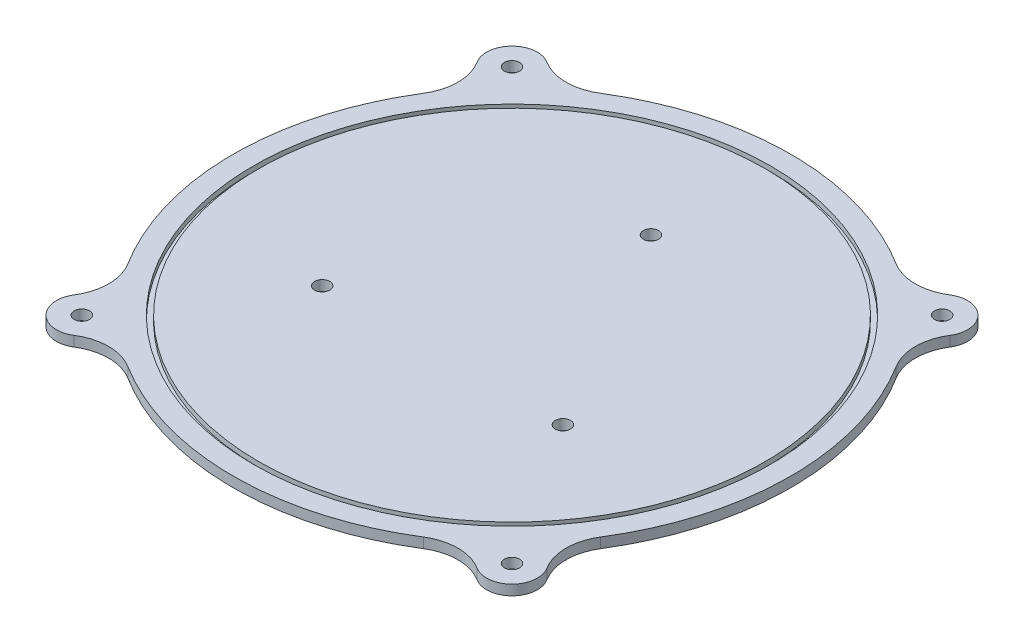
ISO-10303-21;
HEADER;
FILE_DESCRIPTION(('STEP AP214'),'2;1');
FILE_NAME('part.step','',(''),(''),'','','');
FILE_SCHEMA(('AUTOMOTIVE_DESIGN { 1 0 10303 214 1 1 1 1 }'));
ENDSEC;
DATA;
#1=APPLICATION_CONTEXT('core data for automotive mechanical design processes');
#2=APPLICATION_PROTOCOL_DEFINITION('international standard','automotive_design',2000,#1);
#3=PRODUCT_CONTEXT('',#1,'mechanical');
#4=PRODUCT('Part','Part','',(#3));
#5=PRODUCT_RELATED_PRODUCT_CATEGORY('part','',(#4));
#6=PRODUCT_DEFINITION_FORMATION('','',#4);
#7=PRODUCT_DEFINITION_CONTEXT('part definition',#1,'design');
#8=PRODUCT_DEFINITION('design','',#6,#7);
#9=PRODUCT_DEFINITION_SHAPE('','',#8);
#10=(LENGTH_UNIT() NAMED_UNIT(*) SI_UNIT(.MILLI.,.METRE.));
#11=(NAMED_UNIT(*) PLANE_ANGLE_UNIT() SI_UNIT($,.RADIAN.));
#12=(NAMED_UNIT(*) SI_UNIT($,.STERADIAN.) SOLID_ANGLE_UNIT());
#13=UNCERTAINTY_MEASURE_WITH_UNIT(LENGTH_MEASURE(1.E-05),#10,'distance_accuracy_value','');
#14=(GEOMETRIC_REPRESENTATION_CONTEXT(3) GLOBAL_UNCERTAINTY_ASSIGNED_CONTEXT((#13)) GLOBAL_UNIT_ASSIGNED_CONTEXT((#10,
#11,#12)) REPRESENTATION_CONTEXT('',''));
#15=CARTESIAN_POINT('',(0.,0.,0.));
#16=DIRECTION('',(0.,0.,1.));
#17=DIRECTION('',(1.,0.,0.));
#18=AXIS2_PLACEMENT_3D('',#15,#16,#17);
#19=CARTESIAN_POINT('',(-48.7756155256668,2.,-38.434220820674));
#20=DIRECTION('',(0.,1.,0.));
#21=DIRECTION('',(0.,0.,1.));
#22=AXIS2_PLACEMENT_3D('',#19,#20,#21);
#23=PLANE('',#22);
#24=CARTESIAN_POINT('',(0.,2.,-27.4139408136261));
#25=DIRECTION('',(0.,1.,0.));
#26=DIRECTION('',(0.,0.,1.));
#27=AXIS2_PLACEMENT_3D('',#24,#25,#26);
#28=CIRCLE('',#27,1.5);
#29=CARTESIAN_POINT('',(0.,2.,-25.9139408136261));
#30=VERTEX_POINT('',#29);
#31=EDGE_CURVE('E530',#30,#30,#28,.T.);
#32=ORIENTED_EDGE('',*,*,#31,.F.);
#33=EDGE_LOOP('',(#32));
#34=FACE_BOUND('',#33,.T.);
#35=CARTESIAN_POINT('',(-23.7411691624432,2.,13.706970406813));
#36=DIRECTION('',(0.,1.,0.));
#37=DIRECTION('',(0.,0.,1.));
#38=AXIS2_PLACEMENT_3D('',#35,#36,#37);
#39=CIRCLE('',#38,1.5);
#40=CARTESIAN_POINT('',(-23.7411691624432,2.,15.206970406813));
#41=VERTEX_POINT('',#40);
#42=EDGE_CURVE('E183',#41,#41,#39,.T.);
#43=ORIENTED_EDGE('',*,*,#42,.F.);
#44=EDGE_LOOP('',(#43));
#45=FACE_BOUND('',#44,.T.);
#46=CARTESIAN_POINT('',(23.7411691624432,2.,13.706970406813));
#47=DIRECTION('',(0.,1.,0.));
#48=DIRECTION('',(0.,0.,1.));
#49=AXIS2_PLACEMENT_3D('',#46,#47,#48);
#50=CIRCLE('',#49,1.50000000000002);
#51=CARTESIAN_POINT('',(23.7411691624432,2.,15.2069704068131));
#52=VERTEX_POINT('',#51);
#53=EDGE_CURVE('E536',#52,#52,#50,.T.);
#54=ORIENTED_EDGE('',*,*,#53,.F.);
#55=EDGE_LOOP('',(#54));
#56=FACE_BOUND('',#55,.T.);
#57=CARTESIAN_POINT('',(0.,2.,0.));
#58=DIRECTION('',(0.,1.,0.));
#59=DIRECTION('',(0.,0.,1.));
#60=AXIS2_PLACEMENT_3D('',#57,#58,#59);
#61=CIRCLE('',#60,50.);
#62=CARTESIAN_POINT('',(0.,2.,50.));
#63=VERTEX_POINT('',#62);
#64=EDGE_CURVE('E494',#63,#63,#61,.T.);
#65=ORIENTED_EDGE('',*,*,#64,.T.);
#66=EDGE_LOOP('',(#65));
#67=FACE_BOUND('',#66,.T.);
#68=ADVANCED_FACE('F33',(#34,#45,#56,#67),#23,.T.);
#69=CARTESIAN_POINT('',(0.,2.,0.));
#70=DIRECTION('',(0.,1.,0.));
#71=DIRECTION('',(0.,0.,1.));
#72=AXIS2_PLACEMENT_3D('',#69,#70,#71);
#73=CIRCLE('',#72,51.);
#74=CARTESIAN_POINT('',(0.,2.,51.));
#75=VERTEX_POINT('',#74);
#76=EDGE_CURVE('E497',#75,#75,#73,.T.);
#77=ORIENTED_EDGE('',*,*,#76,.F.);
#78=EDGE_LOOP('',(#77));
#79=FACE_BOUND('',#78,.T.);
#80=CARTESIAN_POINT('',(42.4264068711928,2.,42.4264068711929));
#81=DIRECTION('',(0.,1.,0.));
#82=DIRECTION('',(0.,0.,1.));
#83=AXIS2_PLACEMENT_3D('',#80,#81,#82);
#84=CIRCLE('',#83,1.5);
#85=CARTESIAN_POINT('',(42.4264068711928,2.,43.9264068711929));
#86=VERTEX_POINT('',#85);
#87=EDGE_CURVE('E512',#86,#86,#84,.T.);
#88=ORIENTED_EDGE('',*,*,#87,.F.);
#89=EDGE_LOOP('',(#88));
#90=FACE_BOUND('',#89,.T.);
#91=CARTESIAN_POINT('',(-42.4264068711931,2.,-42.4264068711926));
#92=DIRECTION('',(0.,1.,0.));
#93=DIRECTION('',(0.,0.,1.));
#94=AXIS2_PLACEMENT_3D('',#91,#92,#93);
#95=CIRCLE('',#94,1.49999999999999);
#96=CARTESIAN_POINT('',(-42.4264068711931,2.,-40.9264068711926));
#97=VERTEX_POINT('',#96);
#98=EDGE_CURVE('E524',#97,#97,#95,.T.);
#99=ORIENTED_EDGE('',*,*,#98,.F.);
#100=EDGE_LOOP('',(#99));
#101=FACE_BOUND('',#100,.T.);
#102=CARTESIAN_POINT('',(-55.1248241801406,2.,-34.4420347701553));
#103=DIRECTION('',(0.,-1.,0.));
#104=DIRECTION('',(0.,0.,1.));
#105=AXIS2_PLACEMENT_3D('',#102,#103,#104);
#106=CIRCLE('',#105,10.);
#107=CARTESIAN_POINT('',(-46.6592126408422,2.,-39.7649495041802));
#108=VERTEX_POINT('',#107);
#109=CARTESIAN_POINT('',(-46.6440819985805,2.,-29.1432601901315));
#110=VERTEX_POINT('',#109);
#111=EDGE_CURVE('E210',#108,#110,#106,.T.);
#112=ORIENTED_EDGE('',*,*,#111,.T.);
#113=CARTESIAN_POINT('',(0.,2.,0.));
#114=DIRECTION('',(0.,1.,0.));
#115=DIRECTION('',(0.,0.,1.));
#116=AXIS2_PLACEMENT_3D('',#113,#114,#115);
#117=CIRCLE('',#116,55.);
#118=CARTESIAN_POINT('',(-46.6440819985802,2.,29.1432601901319));
#119=VERTEX_POINT('',#118);
#120=EDGE_CURVE('E117',#110,#119,#117,.T.);
#121=ORIENTED_EDGE('',*,*,#120,.T.);
#122=CARTESIAN_POINT('',(-55.1248241801402,2.,34.4420347701559));
#123=DIRECTION('',(0.,-1.,0.));
#124=DIRECTION('',(0.,0.,1.));
#125=AXIS2_PLACEMENT_3D('',#122,#123,#124);
#126=CIRCLE('',#125,9.99999999999999);
#127=CARTESIAN_POINT('',(-46.6592126408418,2.,39.7649495041807));
#128=VERTEX_POINT('',#127);
#129=EDGE_CURVE('E249',#119,#128,#126,.T.);
#130=ORIENTED_EDGE('',*,*,#129,.T.);
#131=CARTESIAN_POINT('',(-42.4264068711931,2.,42.4264068711926));
#132=DIRECTION('',(0.,1.,0.));
#133=DIRECTION('',(0.,0.,1.));
#134=AXIS2_PLACEMENT_3D('',#131,#132,#133);
#135=CIRCLE('',#134,4.99999999999971);
#136=CARTESIAN_POINT('',(-39.7649495041808,2.,46.6592126408416));
#137=VERTEX_POINT('',#136);
#138=EDGE_CURVE('E268',#128,#137,#135,.T.);
#139=ORIENTED_EDGE('',*,*,#138,.T.);
#140=CARTESIAN_POINT('',(-34.4420347701559,2.,55.1248241801402));
#141=DIRECTION('',(0.,-1.,0.));
#142=DIRECTION('',(0.,0.,1.));
#143=AXIS2_PLACEMENT_3D('',#140,#141,#142);
#144=CIRCLE('',#143,10.);
#145=CARTESIAN_POINT('',(-29.1432601901319,2.,46.6440819985802));
#146=VERTEX_POINT('',#145);
#147=EDGE_CURVE('E265',#137,#146,#144,.T.);
#148=ORIENTED_EDGE('',*,*,#147,.T.);
#149=CARTESIAN_POINT('',(0.,2.,0.));
#150=DIRECTION('',(0.,1.,0.));
#151=DIRECTION('',(0.,0.,1.));
#152=AXIS2_PLACEMENT_3D('',#149,#150,#151);
#153=CIRCLE('',#152,55.);
#154=CARTESIAN_POINT('',(29.143260190132,2.,46.6440819985802));
#155=VERTEX_POINT('',#154);
#156=EDGE_CURVE('E267',#146,#155,#153,.T.);
#157=ORIENTED_EDGE('',*,*,#156,.T.);
#158=CARTESIAN_POINT('',(34.4420347701555,2.,55.1248241801404));
#159=DIRECTION('',(0.,-1.,0.));
#160=DIRECTION('',(0.,0.,1.));
#161=AXIS2_PLACEMENT_3D('',#158,#159,#160);
#162=CIRCLE('',#161,10.);
#163=CARTESIAN_POINT('',(39.7649495041804,2.,46.6592126408421));
#164=VERTEX_POINT('',#163);
#165=EDGE_CURVE('E270',#155,#164,#162,.T.);
#166=ORIENTED_EDGE('',*,*,#165,.T.);
#167=CARTESIAN_POINT('',(42.4264068711928,2.,42.4264068711929));
#168=DIRECTION('',(0.,1.,0.));
#169=DIRECTION('',(0.,0.,1.));
#170=AXIS2_PLACEMENT_3D('',#167,#168,#169);
#171=CIRCLE('',#170,5.);
#172=CARTESIAN_POINT('',(46.659212640842,2.,39.7649495041805));
#173=VERTEX_POINT('',#172);
#174=EDGE_CURVE('E276',#164,#173,#171,.T.);
#175=ORIENTED_EDGE('',*,*,#174,.T.);
#176=CARTESIAN_POINT('',(55.1248241801403,2.,34.4420347701557));
#177=DIRECTION('',(0.,-1.,0.));
#178=DIRECTION('',(0.,0.,1.));
#179=AXIS2_PLACEMENT_3D('',#176,#177,#178);
#180=CIRCLE('',#179,10.);
#181=CARTESIAN_POINT('',(46.6440819985803,2.,29.1432601901318));
#182=VERTEX_POINT('',#181);
#183=EDGE_CURVE('E278',#173,#182,#180,.T.);
#184=ORIENTED_EDGE('',*,*,#183,.T.);
#185=CARTESIAN_POINT('',(0.,2.,0.));
#186=DIRECTION('',(0.,1.,0.));
#187=DIRECTION('',(0.,0.,1.));
#188=AXIS2_PLACEMENT_3D('',#185,#186,#187);
#189=CIRCLE('',#188,55.);
#190=CARTESIAN_POINT('',(46.64408199858,2.,-29.1432601901322));
#191=VERTEX_POINT('',#190);
#192=EDGE_CURVE('E280',#182,#191,#189,.T.);
#193=ORIENTED_EDGE('',*,*,#192,.T.);
#194=CARTESIAN_POINT('',(55.1248241801403,2.,-34.4420347701558));
#195=DIRECTION('',(0.,-1.,0.));
#196=DIRECTION('',(0.,0.,1.));
#197=AXIS2_PLACEMENT_3D('',#194,#195,#196);
#198=CIRCLE('',#197,10.);
#199=CARTESIAN_POINT('',(46.6592126408419,2.,-39.7649495041805));
#200=VERTEX_POINT('',#199);
#201=EDGE_CURVE('E282',#191,#200,#198,.T.);
#202=ORIENTED_EDGE('',*,*,#201,.T.);
#203=CARTESIAN_POINT('',(42.4264068711928,2.,-42.4264068711929));
#204=DIRECTION('',(0.,1.,0.));
#205=DIRECTION('',(0.,0.,1.));
#206=AXIS2_PLACEMENT_3D('',#203,#204,#205);
#207=CIRCLE('',#206,4.99999999999999);
#208=CARTESIAN_POINT('',(39.7649495041804,2.,-46.6592126408421));
#209=VERTEX_POINT('',#208);
#210=EDGE_CURVE('E284',#200,#209,#207,.T.);
#211=ORIENTED_EDGE('',*,*,#210,.T.);
#212=CARTESIAN_POINT('',(34.4420347701555,2.,-55.1248241801405));
#213=DIRECTION('',(0.,-1.,0.));
#214=DIRECTION('',(0.,0.,1.));
#215=AXIS2_PLACEMENT_3D('',#212,#213,#214);
#216=CIRCLE('',#215,10.);
#217=CARTESIAN_POINT('',(29.1432601901316,2.,-46.6440819985804));
#218=VERTEX_POINT('',#217);
#219=EDGE_CURVE('E161',#209,#218,#216,.T.);
#220=ORIENTED_EDGE('',*,*,#219,.T.);
#221=CARTESIAN_POINT('',(0.,2.,0.));
#222=DIRECTION('',(0.,1.,0.));
#223=DIRECTION('',(0.,0.,1.));
#224=AXIS2_PLACEMENT_3D('',#221,#222,#223);
#225=CIRCLE('',#224,55.);
#226=CARTESIAN_POINT('',(-29.1432601901319,2.,-46.6440819985802));
#227=VERTEX_POINT('',#226);
#228=EDGE_CURVE('E154',#218,#227,#225,.T.);
#229=ORIENTED_EDGE('',*,*,#228,.T.);
#230=CARTESIAN_POINT('',(-34.4420347701559,2.,-55.1248241801402));
#231=DIRECTION('',(0.,-1.,0.));
#232=DIRECTION('',(0.,0.,1.));
#233=AXIS2_PLACEMENT_3D('',#230,#231,#232);
#234=CIRCLE('',#233,10.);
#235=CARTESIAN_POINT('',(-39.7649495041807,2.,-46.6592126408418));
#236=VERTEX_POINT('',#235);
#237=EDGE_CURVE('E159',#227,#236,#234,.T.);
#238=ORIENTED_EDGE('',*,*,#237,.T.);
#239=CARTESIAN_POINT('',(-42.4264068711931,2.,-42.4264068711926));
#240=DIRECTION('',(0.,1.,0.));
#241=DIRECTION('',(0.,0.,1.));
#242=AXIS2_PLACEMENT_3D('',#239,#240,#241);
#243=CIRCLE('',#242,5.);
#244=EDGE_CURVE('E50',#236,#108,#243,.T.);
#245=ORIENTED_EDGE('',*,*,#244,.T.);
#246=EDGE_LOOP('',(#112,#121,#130,#139,#148,#157,#166,#175,#184,#193,#202,#211,#220,#229,#238,#245));
#247=FACE_BOUND('',#246,.T.);
#248=CARTESIAN_POINT('',(42.4264068711928,2.,-42.4264068711929));
#249=DIRECTION('',(0.,1.,0.));
#250=DIRECTION('',(0.,0.,1.));
#251=AXIS2_PLACEMENT_3D('',#248,#249,#250);
#252=CIRCLE('',#251,1.50000000000001);
#253=CARTESIAN_POINT('',(42.4264068711928,2.,-40.9264068711929));
#254=VERTEX_POINT('',#253);
#255=EDGE_CURVE('E518',#254,#254,#252,.T.);
#256=ORIENTED_EDGE('',*,*,#255,.F.);
#257=EDGE_LOOP('',(#256));
#258=FACE_BOUND('',#257,.T.);
#259=CARTESIAN_POINT('',(-42.4264068711931,2.,42.4264068711926));
#260=DIRECTION('',(0.,1.,0.));
#261=DIRECTION('',(0.,0.,1.));
#262=AXIS2_PLACEMENT_3D('',#259,#260,#261);
#263=CIRCLE('',#262,1.50000000000001);
#264=CARTESIAN_POINT('',(-42.4264068711931,2.,43.9264068711926));
#265=VERTEX_POINT('',#264);
#266=EDGE_CURVE('E506',#265,#265,#263,.T.);
#267=ORIENTED_EDGE('',*,*,#266,.F.);
#268=EDGE_LOOP('',(#267));
#269=FACE_BOUND('',#268,.T.);
#270=ADVANCED_FACE('F156',(#79,#90,#101,#247,#258,#269),#23,.T.);
#271=CARTESIAN_POINT('',(-48.7756155256668,0.,-38.434220820674));
#272=DIRECTION('',(0.,1.,0.));
#273=DIRECTION('',(0.,0.,1.));
#274=AXIS2_PLACEMENT_3D('',#271,#272,#273);
#275=PLANE('',#274);
#276=CARTESIAN_POINT('',(-55.1248241801406,0.,-34.4420347701553));
#277=DIRECTION('',(0.,-1.,0.));
#278=DIRECTION('',(0.,0.,1.));
#279=AXIS2_PLACEMENT_3D('',#276,#277,#278);
#280=CIRCLE('',#279,10.);
#281=CARTESIAN_POINT('',(-46.6592126408422,0.,-39.7649495041802));
#282=VERTEX_POINT('',#281);
#283=CARTESIAN_POINT('',(-46.6440819985805,0.,-29.1432601901315));
#284=VERTEX_POINT('',#283);
#285=EDGE_CURVE('E179',#282,#284,#280,.T.);
#286=ORIENTED_EDGE('',*,*,#285,.F.);
#287=CARTESIAN_POINT('',(-42.4264068711931,0.,-42.4264068711926));
#288=DIRECTION('',(0.,1.,0.));
#289=DIRECTION('',(0.,0.,1.));
#290=AXIS2_PLACEMENT_3D('',#287,#288,#289);
#291=CIRCLE('',#290,5.);
#292=CARTESIAN_POINT('',(-39.7649495041807,0.,-46.6592126408418));
#293=VERTEX_POINT('',#292);
#294=EDGE_CURVE('E109',#293,#282,#291,.T.);
#295=ORIENTED_EDGE('',*,*,#294,.F.);
#296=CARTESIAN_POINT('',(-34.4420347701559,0.,-55.1248241801402));
#297=DIRECTION('',(0.,-1.,0.));
#298=DIRECTION('',(0.,0.,1.));
#299=AXIS2_PLACEMENT_3D('',#296,#297,#298);
#300=CIRCLE('',#299,10.);
#301=CARTESIAN_POINT('',(-29.1432601901319,0.,-46.6440819985802));
#302=VERTEX_POINT('',#301);
#303=EDGE_CURVE('E103',#302,#293,#300,.T.);
#304=ORIENTED_EDGE('',*,*,#303,.F.);
#305=CARTESIAN_POINT('',(0.,0.,0.));
#306=DIRECTION('',(0.,1.,0.));
#307=DIRECTION('',(0.,0.,1.));
#308=AXIS2_PLACEMENT_3D('',#305,#306,#307);
#309=CIRCLE('',#308,55.);
#310=CARTESIAN_POINT('',(29.1432601901316,0.,-46.6440819985804));
#311=VERTEX_POINT('',#310);
#312=EDGE_CURVE('E169',#311,#302,#309,.T.);
#313=ORIENTED_EDGE('',*,*,#312,.F.);
#314=CARTESIAN_POINT('',(34.4420347701555,0.,-55.1248241801405));
#315=DIRECTION('',(0.,-1.,0.));
#316=DIRECTION('',(0.,0.,1.));
#317=AXIS2_PLACEMENT_3D('',#314,#315,#316);
#318=CIRCLE('',#317,10.);
#319=CARTESIAN_POINT('',(39.7649495041804,0.,-46.6592126408421));
#320=VERTEX_POINT('',#319);
#321=EDGE_CURVE('E205',#320,#311,#318,.T.);
#322=ORIENTED_EDGE('',*,*,#321,.F.);
#323=CARTESIAN_POINT('',(42.4264068711928,0.,-42.4264068711929));
#324=DIRECTION('',(0.,1.,0.));
#325=DIRECTION('',(0.,0.,1.));
#326=AXIS2_PLACEMENT_3D('',#323,#324,#325);
#327=CIRCLE('',#326,4.99999999999999);
#328=CARTESIAN_POINT('',(46.6592126408419,0.,-39.7649495041805));
#329=VERTEX_POINT('',#328);
#330=EDGE_CURVE('E203',#329,#320,#327,.T.);
#331=ORIENTED_EDGE('',*,*,#330,.F.);
#332=CARTESIAN_POINT('',(55.1248241801403,0.,-34.4420347701558));
#333=DIRECTION('',(0.,-1.,0.));
#334=DIRECTION('',(0.,0.,1.));
#335=AXIS2_PLACEMENT_3D('',#332,#333,#334);
#336=CIRCLE('',#335,10.);
#337=CARTESIAN_POINT('',(46.64408199858,0.,-29.1432601901322));
#338=VERTEX_POINT('',#337);
#339=EDGE_CURVE('E201',#338,#329,#336,.T.);
#340=ORIENTED_EDGE('',*,*,#339,.F.);
#341=CARTESIAN_POINT('',(0.,0.,0.));
#342=DIRECTION('',(0.,1.,0.));
#343=DIRECTION('',(0.,0.,1.));
#344=AXIS2_PLACEMENT_3D('',#341,#342,#343);
#345=CIRCLE('',#344,55.);
#346=CARTESIAN_POINT('',(46.6440819985803,0.,29.1432601901318));
#347=VERTEX_POINT('',#346);
#348=EDGE_CURVE('E199',#347,#338,#345,.T.);
#349=ORIENTED_EDGE('',*,*,#348,.F.);
#350=CARTESIAN_POINT('',(55.1248241801403,0.,34.4420347701557));
#351=DIRECTION('',(0.,-1.,0.));
#352=DIRECTION('',(0.,0.,1.));
#353=AXIS2_PLACEMENT_3D('',#350,#351,#352);
#354=CIRCLE('',#353,10.);
#355=CARTESIAN_POINT('',(46.659212640842,0.,39.7649495041805));
#356=VERTEX_POINT('',#355);
#357=EDGE_CURVE('E197',#356,#347,#354,.T.);
#358=ORIENTED_EDGE('',*,*,#357,.F.);
#359=CARTESIAN_POINT('',(42.4264068711928,0.,42.4264068711929));
#360=DIRECTION('',(0.,1.,0.));
#361=DIRECTION('',(0.,0.,1.));
#362=AXIS2_PLACEMENT_3D('',#359,#360,#361);
#363=CIRCLE('',#362,5.);
#364=CARTESIAN_POINT('',(39.7649495041804,0.,46.6592126408421));
#365=VERTEX_POINT('',#364);
#366=EDGE_CURVE('E195',#365,#356,#363,.T.);
#367=ORIENTED_EDGE('',*,*,#366,.F.);
#368=CARTESIAN_POINT('',(34.4420347701555,0.,55.1248241801404));
#369=DIRECTION('',(0.,-1.,0.));
#370=DIRECTION('',(0.,0.,1.));
#371=AXIS2_PLACEMENT_3D('',#368,#369,#370);
#372=CIRCLE('',#371,10.);
#373=CARTESIAN_POINT('',(29.143260190132,0.,46.6440819985802));
#374=VERTEX_POINT('',#373);
#375=EDGE_CURVE('E193',#374,#365,#372,.T.);
#376=ORIENTED_EDGE('',*,*,#375,.F.);
#377=CARTESIAN_POINT('',(0.,0.,0.));
#378=DIRECTION('',(0.,1.,0.));
#379=DIRECTION('',(0.,0.,1.));
#380=AXIS2_PLACEMENT_3D('',#377,#378,#379);
#381=CIRCLE('',#380,55.);
#382=CARTESIAN_POINT('',(-29.1432601901319,0.,46.6440819985802));
#383=VERTEX_POINT('',#382);
#384=EDGE_CURVE('E191',#383,#374,#381,.T.);
#385=ORIENTED_EDGE('',*,*,#384,.F.);
#386=CARTESIAN_POINT('',(-34.4420347701559,0.,55.1248241801402));
#387=DIRECTION('',(0.,-1.,0.));
#388=DIRECTION('',(0.,0.,1.));
#389=AXIS2_PLACEMENT_3D('',#386,#387,#388);
#390=CIRCLE('',#389,10.);
#391=CARTESIAN_POINT('',(-39.7649495041808,0.,46.6592126408416));
#392=VERTEX_POINT('',#391);
#393=EDGE_CURVE('E189',#392,#383,#390,.T.);
#394=ORIENTED_EDGE('',*,*,#393,.F.);
#395=CARTESIAN_POINT('',(-42.4264068711931,0.,42.4264068711926));
#396=DIRECTION('',(0.,1.,0.));
#397=DIRECTION('',(0.,0.,1.));
#398=AXIS2_PLACEMENT_3D('',#395,#396,#397);
#399=CIRCLE('',#398,4.99999999999971);
#400=CARTESIAN_POINT('',(-46.6592126408418,0.,39.7649495041807));
#401=VERTEX_POINT('',#400);
#402=EDGE_CURVE('E187',#401,#392,#399,.T.);
#403=ORIENTED_EDGE('',*,*,#402,.F.);
#404=CARTESIAN_POINT('',(-55.1248241801402,0.,34.4420347701559));
#405=DIRECTION('',(0.,-1.,0.));
#406=DIRECTION('',(0.,0.,1.));
#407=AXIS2_PLACEMENT_3D('',#404,#405,#406);
#408=CIRCLE('',#407,9.99999999999999);
#409=CARTESIAN_POINT('',(-46.6440819985802,0.,29.1432601901319));
#410=VERTEX_POINT('',#409);
#411=EDGE_CURVE('E185',#410,#401,#408,.T.);
#412=ORIENTED_EDGE('',*,*,#411,.F.);
#413=CARTESIAN_POINT('',(0.,0.,0.));
#414=DIRECTION('',(0.,1.,0.));
#415=DIRECTION('',(0.,0.,1.));
#416=AXIS2_PLACEMENT_3D('',#413,#414,#415);
#417=CIRCLE('',#416,55.);
#418=EDGE_CURVE('E182',#284,#410,#417,.T.);
#419=ORIENTED_EDGE('',*,*,#418,.F.);
#420=EDGE_LOOP('',(#286,#295,#304,#313,#322,#331,#340,#349,#358,#367,#376,#385,#394,#403,#412,#419));
#421=FACE_BOUND('',#420,.T.);
#422=CARTESIAN_POINT('',(-23.7411691624432,0.,13.706970406813));
#423=DIRECTION('',(0.,1.,0.));
#424=DIRECTION('',(0.,0.,1.));
#425=AXIS2_PLACEMENT_3D('',#422,#423,#424);
#426=CIRCLE('',#425,1.5);
#427=CARTESIAN_POINT('',(-23.7411691624432,0.,15.206970406813));
#428=VERTEX_POINT('',#427);
#429=EDGE_CURVE('E539',#428,#428,#426,.T.);
#430=ORIENTED_EDGE('',*,*,#429,.T.);
#431=EDGE_LOOP('',(#430));
#432=FACE_BOUND('',#431,.T.);
#433=CARTESIAN_POINT('',(23.7411691624432,0.,13.706970406813));
#434=DIRECTION('',(0.,1.,0.));
#435=DIRECTION('',(0.,0.,1.));
#436=AXIS2_PLACEMENT_3D('',#433,#434,#435);
#437=CIRCLE('',#436,1.50000000000002);
#438=CARTESIAN_POINT('',(23.7411691624432,0.,15.2069704068131));
#439=VERTEX_POINT('',#438);
#440=EDGE_CURVE('E533',#439,#439,#437,.T.);
#441=ORIENTED_EDGE('',*,*,#440,.T.);
#442=EDGE_LOOP('',(#441));
#443=FACE_BOUND('',#442,.T.);
#444=CARTESIAN_POINT('',(0.,0.,-27.4139408136261));
#445=DIRECTION('',(0.,1.,0.));
#446=DIRECTION('',(0.,0.,1.));
#447=AXIS2_PLACEMENT_3D('',#444,#445,#446);
#448=CIRCLE('',#447,1.5);
#449=CARTESIAN_POINT('',(0.,0.,-25.9139408136261));
#450=VERTEX_POINT('',#449);
#451=EDGE_CURVE('E527',#450,#450,#448,.T.);
#452=ORIENTED_EDGE('',*,*,#451,.T.);
#453=EDGE_LOOP('',(#452));
#454=FACE_BOUND('',#453,.T.);
#455=CARTESIAN_POINT('',(-42.4264068711931,0.,-42.4264068711926));
#456=DIRECTION('',(0.,1.,0.));
#457=DIRECTION('',(0.,0.,1.));
#458=AXIS2_PLACEMENT_3D('',#455,#456,#457);
#459=CIRCLE('',#458,1.49999999999999);
#460=CARTESIAN_POINT('',(-42.4264068711931,0.,-40.9264068711926));
#461=VERTEX_POINT('',#460);
#462=EDGE_CURVE('E521',#461,#461,#459,.T.);
#463=ORIENTED_EDGE('',*,*,#462,.T.);
#464=EDGE_LOOP('',(#463));
#465=FACE_BOUND('',#464,.T.);
#466=CARTESIAN_POINT('',(42.4264068711928,0.,-42.4264068711929));
#467=DIRECTION('',(0.,1.,0.));
#468=DIRECTION('',(0.,0.,1.));
#469=AXIS2_PLACEMENT_3D('',#466,#467,#468);
#470=CIRCLE('',#469,1.50000000000001);
#471=CARTESIAN_POINT('',(42.4264068711928,0.,-40.9264068711929));
#472=VERTEX_POINT('',#471);
#473=EDGE_CURVE('E515',#472,#472,#470,.T.);
#474=ORIENTED_EDGE('',*,*,#473,.T.);
#475=EDGE_LOOP('',(#474));
#476=FACE_BOUND('',#475,.T.);
#477=CARTESIAN_POINT('',(42.4264068711928,0.,42.4264068711929));
#478=DIRECTION('',(0.,1.,0.));
#479=DIRECTION('',(0.,0.,1.));
#480=AXIS2_PLACEMENT_3D('',#477,#478,#479);
#481=CIRCLE('',#480,1.5);
#482=CARTESIAN_POINT('',(42.4264068711928,0.,43.9264068711929));
#483=VERTEX_POINT('',#482);
#484=EDGE_CURVE('E509',#483,#483,#481,.T.);
#485=ORIENTED_EDGE('',*,*,#484,.T.);
#486=EDGE_LOOP('',(#485));
#487=FACE_BOUND('',#486,.T.);
#488=CARTESIAN_POINT('',(-42.4264068711931,0.,42.4264068711926));
#489=DIRECTION('',(0.,1.,0.));
#490=DIRECTION('',(0.,0.,1.));
#491=AXIS2_PLACEMENT_3D('',#488,#489,#490);
#492=CIRCLE('',#491,1.50000000000001);
#493=CARTESIAN_POINT('',(-42.4264068711931,0.,43.9264068711926));
#494=VERTEX_POINT('',#493);
#495=EDGE_CURVE('E503',#494,#494,#492,.T.);
#496=ORIENTED_EDGE('',*,*,#495,.T.);
#497=EDGE_LOOP('',(#496));
#498=FACE_BOUND('',#497,.T.);
#499=ADVANCED_FACE('F253',(#421,#432,#443,#454,#465,#476,#487,#498),#275,.F.);
#500=CARTESIAN_POINT('',(-55.1248241801406,2.,-34.4420347701553));
#501=DIRECTION('',(0.,-1.,0.));
#502=DIRECTION('',(0.,0.,-1.));
#503=AXIS2_PLACEMENT_3D('',#500,#501,#502);
#504=CYLINDRICAL_SURFACE('',#503,10.);
#505=ORIENTED_EDGE('',*,*,#285,.T.);
#506=DIRECTION('',(0.,-1.,0.));
#507=VECTOR('',#506,1.);
#508=CARTESIAN_POINT('',(-46.6440819985805,2.,-29.1432601901315));
#509=LINE('',#508,#507);
#510=EDGE_CURVE('E11',#110,#284,#509,.T.);
#511=ORIENTED_EDGE('',*,*,#510,.F.);
#512=ORIENTED_EDGE('',*,*,#111,.F.);
#513=DIRECTION('',(0.,-1.,0.));
#514=VECTOR('',#513,1.);
#515=CARTESIAN_POINT('',(-46.6592126408422,2.,-39.7649495041802));
#516=LINE('',#515,#514);
#517=EDGE_CURVE('E175',#108,#282,#516,.T.);
#518=ORIENTED_EDGE('',*,*,#517,.T.);
#519=EDGE_LOOP('',(#505,#511,#512,#518));
#520=FACE_BOUND('',#519,.T.);
#521=ADVANCED_FACE('F35',(#520),#504,.F.);
#522=CARTESIAN_POINT('',(0.,2.,0.));
#523=DIRECTION('',(0.,-1.,0.));
#524=DIRECTION('',(0.,0.,-1.));
#525=AXIS2_PLACEMENT_3D('',#522,#523,#524);
#526=CYLINDRICAL_SURFACE('',#525,55.);
#527=ORIENTED_EDGE('',*,*,#418,.T.);
#528=DIRECTION('',(0.,-1.,0.));
#529=VECTOR('',#528,1.);
#530=CARTESIAN_POINT('',(-46.6440819985802,2.,29.1432601901319));
#531=LINE('',#530,#529);
#532=EDGE_CURVE('E42',#119,#410,#531,.T.);
#533=ORIENTED_EDGE('',*,*,#532,.F.);
#534=ORIENTED_EDGE('',*,*,#120,.F.);
#535=ORIENTED_EDGE('',*,*,#510,.T.);
#536=EDGE_LOOP('',(#527,#533,#534,#535));
#537=FACE_BOUND('',#536,.T.);
#538=ADVANCED_FACE('F325',(#537),#526,.T.);
#539=CARTESIAN_POINT('',(-55.1248241801402,2.,34.4420347701559));
#540=DIRECTION('',(0.,-1.,0.));
#541=DIRECTION('',(0.,0.,-1.));
#542=AXIS2_PLACEMENT_3D('',#539,#540,#541);
#543=CYLINDRICAL_SURFACE('',#542,9.99999999999999);
#544=ORIENTED_EDGE('',*,*,#411,.T.);
#545=DIRECTION('',(0.,-1.,0.));
#546=VECTOR('',#545,1.);
#547=CARTESIAN_POINT('',(-46.6592126408418,2.,39.7649495041807));
#548=LINE('',#547,#546);
#549=EDGE_CURVE('E241',#128,#401,#548,.T.);
#550=ORIENTED_EDGE('',*,*,#549,.F.);
#551=ORIENTED_EDGE('',*,*,#129,.F.);
#552=ORIENTED_EDGE('',*,*,#532,.T.);
#553=EDGE_LOOP('',(#544,#550,#551,#552));
#554=FACE_BOUND('',#553,.T.);
#555=ADVANCED_FACE('F247',(#554),#543,.F.);
#556=CARTESIAN_POINT('',(-42.4264068711931,2.,42.4264068711926));
#557=DIRECTION('',(0.,-1.,0.));
#558=DIRECTION('',(0.,0.,-1.));
#559=AXIS2_PLACEMENT_3D('',#556,#557,#558);
#560=CYLINDRICAL_SURFACE('',#559,4.99999999999971);
#561=ORIENTED_EDGE('',*,*,#402,.T.);
#562=DIRECTION('',(0.,-1.,0.));
#563=VECTOR('',#562,1.);
#564=CARTESIAN_POINT('',(-39.7649495041808,2.,46.6592126408416));
#565=LINE('',#564,#563);
#566=EDGE_CURVE('E238',#137,#392,#565,.T.);
#567=ORIENTED_EDGE('',*,*,#566,.F.);
#568=ORIENTED_EDGE('',*,*,#138,.F.);
#569=ORIENTED_EDGE('',*,*,#549,.T.);
#570=EDGE_LOOP('',(#561,#567,#568,#569));
#571=FACE_BOUND('',#570,.T.);
#572=ADVANCED_FACE('F259',(#571),#560,.T.);
#573=CARTESIAN_POINT('',(-34.4420347701559,2.,55.1248241801402));
#574=DIRECTION('',(0.,-1.,0.));
#575=DIRECTION('',(0.,0.,-1.));
#576=AXIS2_PLACEMENT_3D('',#573,#574,#575);
#577=CYLINDRICAL_SURFACE('',#576,10.);
#578=ORIENTED_EDGE('',*,*,#393,.T.);
#579=DIRECTION('',(0.,-1.,0.));
#580=VECTOR('',#579,1.);
#581=CARTESIAN_POINT('',(-29.1432601901319,2.,46.6440819985802));
#582=LINE('',#581,#580);
#583=EDGE_CURVE('E235',#146,#383,#582,.T.);
#584=ORIENTED_EDGE('',*,*,#583,.F.);
#585=ORIENTED_EDGE('',*,*,#147,.F.);
#586=ORIENTED_EDGE('',*,*,#566,.T.);
#587=EDGE_LOOP('',(#578,#584,#585,#586));
#588=FACE_BOUND('',#587,.T.);
#589=ADVANCED_FACE('F263',(#588),#577,.F.);
#590=CARTESIAN_POINT('',(0.,2.,0.));
#591=DIRECTION('',(0.,-1.,0.));
#592=DIRECTION('',(0.,0.,-1.));
#593=AXIS2_PLACEMENT_3D('',#590,#591,#592);
#594=CYLINDRICAL_SURFACE('',#593,55.);
#595=ORIENTED_EDGE('',*,*,#384,.T.);
#596=DIRECTION('',(0.,-1.,0.));
#597=VECTOR('',#596,1.);
#598=CARTESIAN_POINT('',(29.143260190132,2.,46.6440819985802));
#599=LINE('',#598,#597);
#600=EDGE_CURVE('E232',#155,#374,#599,.T.);
#601=ORIENTED_EDGE('',*,*,#600,.F.);
#602=ORIENTED_EDGE('',*,*,#156,.F.);
#603=ORIENTED_EDGE('',*,*,#583,.T.);
#604=EDGE_LOOP('',(#595,#601,#602,#603));
#605=FACE_BOUND('',#604,.T.);
#606=ADVANCED_FACE('F338',(#605),#594,.T.);
#607=CARTESIAN_POINT('',(34.4420347701555,2.,55.1248241801404));
#608=DIRECTION('',(0.,-1.,0.));
#609=DIRECTION('',(0.,0.,-1.));
#610=AXIS2_PLACEMENT_3D('',#607,#608,#609);
#611=CYLINDRICAL_SURFACE('',#610,10.);
#612=ORIENTED_EDGE('',*,*,#375,.T.);
#613=DIRECTION('',(0.,-1.,0.));
#614=VECTOR('',#613,1.);
#615=CARTESIAN_POINT('',(39.7649495041804,2.,46.6592126408421));
#616=LINE('',#615,#614);
#617=EDGE_CURVE('E229',#164,#365,#616,.T.);
#618=ORIENTED_EDGE('',*,*,#617,.F.);
#619=ORIENTED_EDGE('',*,*,#165,.F.);
#620=ORIENTED_EDGE('',*,*,#600,.T.);
#621=EDGE_LOOP('',(#612,#618,#619,#620));
#622=FACE_BOUND('',#621,.T.);
#623=ADVANCED_FACE('F341',(#622),#611,.F.);
#624=CARTESIAN_POINT('',(42.4264068711928,2.,42.4264068711929));
#625=DIRECTION('',(0.,-1.,0.));
#626=DIRECTION('',(0.,0.,-1.));
#627=AXIS2_PLACEMENT_3D('',#624,#625,#626);
#628=CYLINDRICAL_SURFACE('',#627,5.);
#629=ORIENTED_EDGE('',*,*,#366,.T.);
#630=DIRECTION('',(0.,-1.,0.));
#631=VECTOR('',#630,1.);
#632=CARTESIAN_POINT('',(46.659212640842,2.,39.7649495041805));
#633=LINE('',#632,#631);
#634=EDGE_CURVE('E226',#173,#356,#633,.T.);
#635=ORIENTED_EDGE('',*,*,#634,.F.);
#636=ORIENTED_EDGE('',*,*,#174,.F.);
#637=ORIENTED_EDGE('',*,*,#617,.T.);
#638=EDGE_LOOP('',(#629,#635,#636,#637));
#639=FACE_BOUND('',#638,.T.);
#640=ADVANCED_FACE('F345',(#639),#628,.T.);
#641=CARTESIAN_POINT('',(55.1248241801403,2.,34.4420347701557));
#642=DIRECTION('',(0.,-1.,0.));
#643=DIRECTION('',(0.,0.,-1.));
#644=AXIS2_PLACEMENT_3D('',#641,#642,#643);
#645=CYLINDRICAL_SURFACE('',#644,10.);
#646=ORIENTED_EDGE('',*,*,#357,.T.);
#647=DIRECTION('',(0.,-1.,0.));
#648=VECTOR('',#647,1.);
#649=CARTESIAN_POINT('',(46.6440819985803,2.,29.1432601901318));
#650=LINE('',#649,#648);
#651=EDGE_CURVE('E223',#182,#347,#650,.T.);
#652=ORIENTED_EDGE('',*,*,#651,.F.);
#653=ORIENTED_EDGE('',*,*,#183,.F.);
#654=ORIENTED_EDGE('',*,*,#634,.T.);
#655=EDGE_LOOP('',(#646,#652,#653,#654));
#656=FACE_BOUND('',#655,.T.);
#657=ADVANCED_FACE('F349',(#656),#645,.F.);
#658=CARTESIAN_POINT('',(0.,2.,0.));
#659=DIRECTION('',(0.,-1.,0.));
#660=DIRECTION('',(0.,0.,-1.));
#661=AXIS2_PLACEMENT_3D('',#658,#659,#660);
#662=CYLINDRICAL_SURFACE('',#661,55.);
#663=ORIENTED_EDGE('',*,*,#348,.T.);
#664=DIRECTION('',(0.,-1.,0.));
#665=VECTOR('',#664,1.);
#666=CARTESIAN_POINT('',(46.64408199858,2.,-29.1432601901322));
#667=LINE('',#666,#665);
#668=EDGE_CURVE('E220',#191,#338,#667,.T.);
#669=ORIENTED_EDGE('',*,*,#668,.F.);
#670=ORIENTED_EDGE('',*,*,#192,.F.);
#671=ORIENTED_EDGE('',*,*,#651,.T.);
#672=EDGE_LOOP('',(#663,#669,#670,#671));
#673=FACE_BOUND('',#672,.T.);
#674=ADVANCED_FACE('F353',(#673),#662,.T.);
#675=CARTESIAN_POINT('',(55.1248241801403,2.,-34.4420347701558));
#676=DIRECTION('',(0.,-1.,0.));
#677=DIRECTION('',(0.,0.,-1.));
#678=AXIS2_PLACEMENT_3D('',#675,#676,#677);
#679=CYLINDRICAL_SURFACE('',#678,10.);
#680=ORIENTED_EDGE('',*,*,#339,.T.);
#681=DIRECTION('',(0.,-1.,0.));
#682=VECTOR('',#681,1.);
#683=CARTESIAN_POINT('',(46.6592126408419,2.,-39.7649495041805));
#684=LINE('',#683,#682);
#685=EDGE_CURVE('E217',#200,#329,#684,.T.);
#686=ORIENTED_EDGE('',*,*,#685,.F.);
#687=ORIENTED_EDGE('',*,*,#201,.F.);
#688=ORIENTED_EDGE('',*,*,#668,.T.);
#689=EDGE_LOOP('',(#680,#686,#687,#688));
#690=FACE_BOUND('',#689,.T.);
#691=ADVANCED_FACE('F357',(#690),#679,.F.);
#692=CARTESIAN_POINT('',(42.4264068711928,2.,-42.4264068711929));
#693=DIRECTION('',(0.,-1.,0.));
#694=DIRECTION('',(0.,0.,-1.));
#695=AXIS2_PLACEMENT_3D('',#692,#693,#694);
#696=CYLINDRICAL_SURFACE('',#695,4.99999999999999);
#697=ORIENTED_EDGE('',*,*,#330,.T.);
#698=DIRECTION('',(0.,-1.,0.));
#699=VECTOR('',#698,1.);
#700=CARTESIAN_POINT('',(39.7649495041804,2.,-46.6592126408421));
#701=LINE('',#700,#699);
#702=EDGE_CURVE('E214',#209,#320,#701,.T.);
#703=ORIENTED_EDGE('',*,*,#702,.F.);
#704=ORIENTED_EDGE('',*,*,#210,.F.);
#705=ORIENTED_EDGE('',*,*,#685,.T.);
#706=EDGE_LOOP('',(#697,#703,#704,#705));
#707=FACE_BOUND('',#706,.T.);
#708=ADVANCED_FACE('F290',(#707),#696,.T.);
#709=CARTESIAN_POINT('',(34.4420347701555,2.,-55.1248241801405));
#710=DIRECTION('',(0.,-1.,0.));
#711=DIRECTION('',(0.,0.,-1.));
#712=AXIS2_PLACEMENT_3D('',#709,#710,#711);
#713=CYLINDRICAL_SURFACE('',#712,10.);
#714=ORIENTED_EDGE('',*,*,#321,.T.);
#715=DIRECTION('',(0.,-1.,0.));
#716=VECTOR('',#715,1.);
#717=CARTESIAN_POINT('',(29.1432601901316,2.,-46.6440819985804));
#718=LINE('',#717,#716);
#719=EDGE_CURVE('E170',#218,#311,#718,.T.);
#720=ORIENTED_EDGE('',*,*,#719,.F.);
#721=ORIENTED_EDGE('',*,*,#219,.F.);
#722=ORIENTED_EDGE('',*,*,#702,.T.);
#723=EDGE_LOOP('',(#714,#720,#721,#722));
#724=FACE_BOUND('',#723,.T.);
#725=ADVANCED_FACE('F294',(#724),#713,.F.);
#726=CARTESIAN_POINT('',(0.,2.,0.));
#727=DIRECTION('',(0.,-1.,0.));
#728=DIRECTION('',(0.,0.,-1.));
#729=AXIS2_PLACEMENT_3D('',#726,#727,#728);
#730=CYLINDRICAL_SURFACE('',#729,55.);
#731=ORIENTED_EDGE('',*,*,#312,.T.);
#732=DIRECTION('',(0.,-1.,0.));
#733=VECTOR('',#732,1.);
#734=CARTESIAN_POINT('',(-29.1432601901319,2.,-46.6440819985802));
#735=LINE('',#734,#733);
#736=EDGE_CURVE('E166',#227,#302,#735,.T.);
#737=ORIENTED_EDGE('',*,*,#736,.F.);
#738=ORIENTED_EDGE('',*,*,#228,.F.);
#739=ORIENTED_EDGE('',*,*,#719,.T.);
#740=EDGE_LOOP('',(#731,#737,#738,#739));
#741=FACE_BOUND('',#740,.T.);
#742=ADVANCED_FACE('F167',(#741),#730,.T.);
#743=CARTESIAN_POINT('',(-34.4420347701559,2.,-55.1248241801402));
#744=DIRECTION('',(0.,-1.,0.));
#745=DIRECTION('',(0.,0.,-1.));
#746=AXIS2_PLACEMENT_3D('',#743,#744,#745);
#747=CYLINDRICAL_SURFACE('',#746,10.);
#748=ORIENTED_EDGE('',*,*,#303,.T.);
#749=DIRECTION('',(0.,-1.,0.));
#750=VECTOR('',#749,1.);
#751=CARTESIAN_POINT('',(-39.7649495041807,2.,-46.6592126408418));
#752=LINE('',#751,#750);
#753=EDGE_CURVE('E171',#236,#293,#752,.T.);
#754=ORIENTED_EDGE('',*,*,#753,.F.);
#755=ORIENTED_EDGE('',*,*,#237,.F.);
#756=ORIENTED_EDGE('',*,*,#736,.T.);
#757=EDGE_LOOP('',(#748,#754,#755,#756));
#758=FACE_BOUND('',#757,.T.);
#759=ADVANCED_FACE('F173',(#758),#747,.F.);
#760=CARTESIAN_POINT('',(-42.4264068711931,2.,-42.4264068711926));
#761=DIRECTION('',(0.,-1.,0.));
#762=DIRECTION('',(0.,0.,-1.));
#763=AXIS2_PLACEMENT_3D('',#760,#761,#762);
#764=CYLINDRICAL_SURFACE('',#763,5.);
#765=ORIENTED_EDGE('',*,*,#294,.T.);
#766=ORIENTED_EDGE('',*,*,#517,.F.);
#767=ORIENTED_EDGE('',*,*,#244,.F.);
#768=ORIENTED_EDGE('',*,*,#753,.T.);
#769=EDGE_LOOP('',(#765,#766,#767,#768));
#770=FACE_BOUND('',#769,.T.);
#771=ADVANCED_FACE('F298',(#770),#764,.T.);
#772=CARTESIAN_POINT('',(-23.7411691624432,2.,13.706970406813));
#773=DIRECTION('',(0.,-1.,0.));
#774=DIRECTION('',(0.,0.,-1.));
#775=AXIS2_PLACEMENT_3D('',#772,#773,#774);
#776=CYLINDRICAL_SURFACE('',#775,1.5);
#777=ORIENTED_EDGE('',*,*,#42,.T.);
#778=EDGE_LOOP('',(#777));
#779=FACE_BOUND('',#778,.T.);
#780=ORIENTED_EDGE('',*,*,#429,.F.);
#781=EDGE_LOOP('',(#780));
#782=FACE_BOUND('',#781,.T.);
#783=ADVANCED_FACE('F300',(#779,#782),#776,.F.);
#784=CARTESIAN_POINT('',(23.7411691624432,2.,13.706970406813));
#785=DIRECTION('',(0.,-1.,0.));
#786=DIRECTION('',(0.,0.,-1.));
#787=AXIS2_PLACEMENT_3D('',#784,#785,#786);
#788=CYLINDRICAL_SURFACE('',#787,1.50000000000002);
#789=ORIENTED_EDGE('',*,*,#53,.T.);
#790=EDGE_LOOP('',(#789));
#791=FACE_BOUND('',#790,.T.);
#792=ORIENTED_EDGE('',*,*,#440,.F.);
#793=EDGE_LOOP('',(#792));
#794=FACE_BOUND('',#793,.T.);
#795=ADVANCED_FACE('F306',(#791,#794),#788,.F.);
#796=CARTESIAN_POINT('',(0.,2.,-27.4139408136261));
#797=DIRECTION('',(0.,-1.,0.));
#798=DIRECTION('',(0.,0.,-1.));
#799=AXIS2_PLACEMENT_3D('',#796,#797,#798);
#800=CYLINDRICAL_SURFACE('',#799,1.5);
#801=ORIENTED_EDGE('',*,*,#31,.T.);
#802=EDGE_LOOP('',(#801));
#803=FACE_BOUND('',#802,.T.);
#804=ORIENTED_EDGE('',*,*,#451,.F.);
#805=EDGE_LOOP('',(#804));
#806=FACE_BOUND('',#805,.T.);
#807=ADVANCED_FACE('F394',(#803,#806),#800,.F.);
#808=CARTESIAN_POINT('',(-42.4264068711931,2.,-42.4264068711926));
#809=DIRECTION('',(0.,-1.,0.));
#810=DIRECTION('',(0.,0.,-1.));
#811=AXIS2_PLACEMENT_3D('',#808,#809,#810);
#812=CYLINDRICAL_SURFACE('',#811,1.49999999999999);
#813=ORIENTED_EDGE('',*,*,#98,.T.);
#814=EDGE_LOOP('',(#813));
#815=FACE_BOUND('',#814,.T.);
#816=ORIENTED_EDGE('',*,*,#462,.F.);
#817=EDGE_LOOP('',(#816));
#818=FACE_BOUND('',#817,.T.);
#819=ADVANCED_FACE('F403',(#815,#818),#812,.F.);
#820=CARTESIAN_POINT('',(42.4264068711928,2.,-42.4264068711929));
#821=DIRECTION('',(0.,-1.,0.));
#822=DIRECTION('',(0.,0.,-1.));
#823=AXIS2_PLACEMENT_3D('',#820,#821,#822);
#824=CYLINDRICAL_SURFACE('',#823,1.50000000000001);
#825=ORIENTED_EDGE('',*,*,#255,.T.);
#826=EDGE_LOOP('',(#825));
#827=FACE_BOUND('',#826,.T.);
#828=ORIENTED_EDGE('',*,*,#473,.F.);
#829=EDGE_LOOP('',(#828));
#830=FACE_BOUND('',#829,.T.);
#831=ADVANCED_FACE('F413',(#827,#830),#824,.F.);
#832=CARTESIAN_POINT('',(42.4264068711928,2.,42.4264068711929));
#833=DIRECTION('',(0.,-1.,0.));
#834=DIRECTION('',(0.,0.,-1.));
#835=AXIS2_PLACEMENT_3D('',#832,#833,#834);
#836=CYLINDRICAL_SURFACE('',#835,1.5);
#837=ORIENTED_EDGE('',*,*,#87,.T.);
#838=EDGE_LOOP('',(#837));
#839=FACE_BOUND('',#838,.T.);
#840=ORIENTED_EDGE('',*,*,#484,.F.);
#841=EDGE_LOOP('',(#840));
#842=FACE_BOUND('',#841,.T.);
#843=ADVANCED_FACE('F423',(#839,#842),#836,.F.);
#844=CARTESIAN_POINT('',(-42.4264068711931,2.,42.4264068711926));
#845=DIRECTION('',(0.,-1.,0.));
#846=DIRECTION('',(0.,0.,-1.));
#847=AXIS2_PLACEMENT_3D('',#844,#845,#846);
#848=CYLINDRICAL_SURFACE('',#847,1.50000000000001);
#849=ORIENTED_EDGE('',*,*,#266,.T.);
#850=EDGE_LOOP('',(#849));
#851=FACE_BOUND('',#850,.T.);
#852=ORIENTED_EDGE('',*,*,#495,.F.);
#853=EDGE_LOOP('',(#852));
#854=FACE_BOUND('',#853,.T.);
#855=ADVANCED_FACE('F433',(#851,#854),#848,.F.);
#856=CARTESIAN_POINT('',(0.,1.,0.));
#857=DIRECTION('',(0.,1.,0.));
#858=DIRECTION('',(0.,0.,1.));
#859=AXIS2_PLACEMENT_3D('',#856,#857,#858);
#860=CYLINDRICAL_SURFACE('',#859,51.);
#861=CARTESIAN_POINT('',(0.,1.,0.));
#862=DIRECTION('',(0.,1.,0.));
#863=DIRECTION('',(0.,0.,1.));
#864=AXIS2_PLACEMENT_3D('',#861,#862,#863);
#865=CIRCLE('',#864,51.);
#866=CARTESIAN_POINT('',(0.,1.,51.));
#867=VERTEX_POINT('',#866);
#868=EDGE_CURVE('E500',#867,#867,#865,.T.);
#869=ORIENTED_EDGE('',*,*,#868,.F.);
#870=EDGE_LOOP('',(#869));
#871=FACE_BOUND('',#870,.T.);
#872=ORIENTED_EDGE('',*,*,#76,.T.);
#873=EDGE_LOOP('',(#872));
#874=FACE_BOUND('',#873,.T.);
#875=ADVANCED_FACE('F442',(#871,#874),#860,.F.);
#876=CARTESIAN_POINT('',(0.,1.,0.));
#877=DIRECTION('',(0.,1.,0.));
#878=DIRECTION('',(0.,0.,1.));
#879=AXIS2_PLACEMENT_3D('',#876,#877,#878);
#880=PLANE('',#879);
#881=CARTESIAN_POINT('',(0.,1.,0.));
#882=DIRECTION('',(0.,1.,0.));
#883=DIRECTION('',(0.,0.,1.));
#884=AXIS2_PLACEMENT_3D('',#881,#882,#883);
#885=CIRCLE('',#884,50.);
#886=CARTESIAN_POINT('',(0.,1.,50.));
#887=VERTEX_POINT('',#886);
#888=EDGE_CURVE('E491',#887,#887,#885,.T.);
#889=ORIENTED_EDGE('',*,*,#888,.F.);
#890=EDGE_LOOP('',(#889));
#891=FACE_BOUND('',#890,.T.);
#892=ORIENTED_EDGE('',*,*,#868,.T.);
#893=EDGE_LOOP('',(#892));
#894=FACE_BOUND('',#893,.T.);
#895=ADVANCED_FACE('F464',(#891,#894),#880,.T.);
#896=CARTESIAN_POINT('',(0.,1.,0.));
#897=DIRECTION('',(0.,1.,0.));
#898=DIRECTION('',(0.,0.,1.));
#899=AXIS2_PLACEMENT_3D('',#896,#897,#898);
#900=CYLINDRICAL_SURFACE('',#899,50.);
#901=ORIENTED_EDGE('',*,*,#888,.T.);
#902=EDGE_LOOP('',(#901));
#903=FACE_BOUND('',#902,.T.);
#904=ORIENTED_EDGE('',*,*,#64,.F.);
#905=EDGE_LOOP('',(#904));
#906=FACE_BOUND('',#905,.T.);
#907=ADVANCED_FACE('F474',(#903,#906),#900,.T.);
#908=CLOSED_SHELL('',(#68,#270,#499,#521,#538,#555,#572,#589,#606,#623,#640,#657,#674,#691,#708,
#725,#742,#759,#771,#783,#795,#807,#819,#831,#843,#855,#875,#895,#907));
#909=MANIFOLD_SOLID_BREP('B2',#908);
#910=ADVANCED_BREP_SHAPE_REPRESENTATION('',(#18,#909),#14);
#911=SHAPE_DEFINITION_REPRESENTATION(#9,#910);
ENDSEC;
END-ISO-10303-21;
